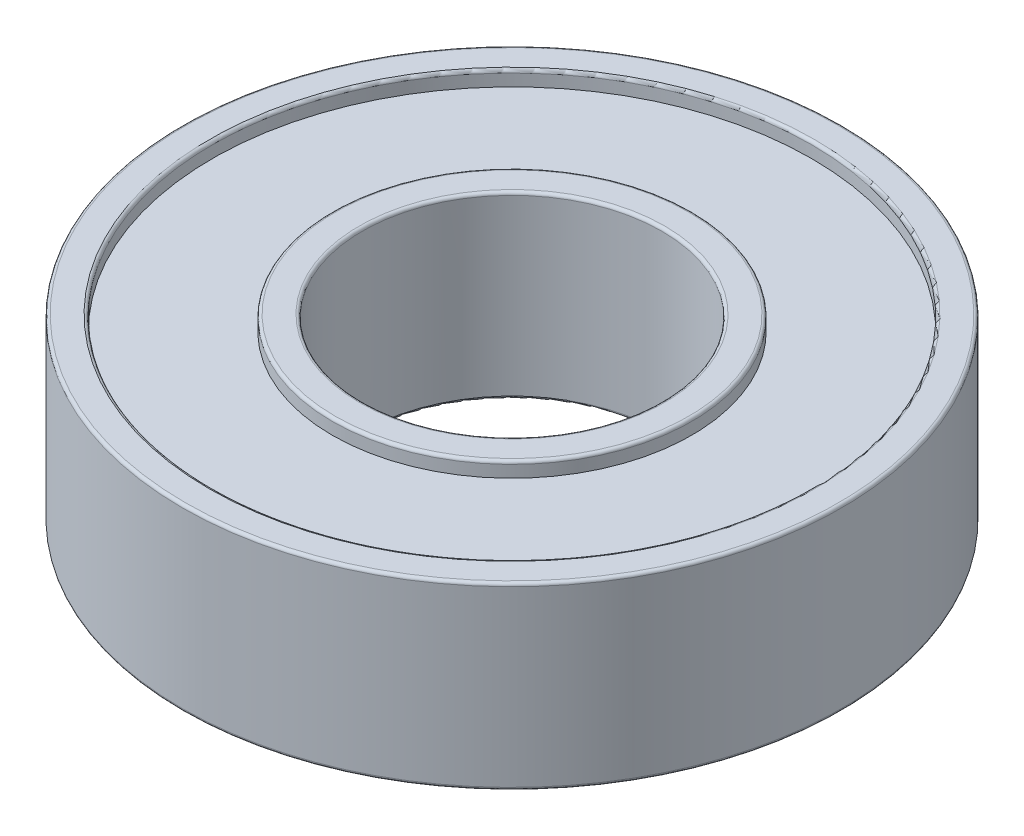
ISO-10303-21;
HEADER;
FILE_DESCRIPTION(('STEP AP214'),'2;1');
FILE_NAME('part.step','',(''),(''),'','','');
FILE_SCHEMA(('AUTOMOTIVE_DESIGN { 1 0 10303 214 1 1 1 1 }'));
ENDSEC;
DATA;
#1=APPLICATION_CONTEXT('core data for automotive mechanical design processes');
#2=APPLICATION_PROTOCOL_DEFINITION('international standard','automotive_design',2000,#1);
#3=PRODUCT_CONTEXT('',#1,'mechanical');
#4=PRODUCT('Part','Part','',(#3));
#5=PRODUCT_RELATED_PRODUCT_CATEGORY('part','',(#4));
#6=PRODUCT_DEFINITION_FORMATION('','',#4);
#7=PRODUCT_DEFINITION_CONTEXT('part definition',#1,'design');
#8=PRODUCT_DEFINITION('design','',#6,#7);
#9=PRODUCT_DEFINITION_SHAPE('','',#8);
#10=(LENGTH_UNIT() NAMED_UNIT(*) SI_UNIT(.MILLI.,.METRE.));
#11=(NAMED_UNIT(*) PLANE_ANGLE_UNIT() SI_UNIT($,.RADIAN.));
#12=(NAMED_UNIT(*) SI_UNIT($,.STERADIAN.) SOLID_ANGLE_UNIT());
#13=UNCERTAINTY_MEASURE_WITH_UNIT(LENGTH_MEASURE(1.E-05),#10,'distance_accuracy_value','');
#14=(GEOMETRIC_REPRESENTATION_CONTEXT(3) GLOBAL_UNCERTAINTY_ASSIGNED_CONTEXT((#13)) GLOBAL_UNIT_ASSIGNED_CONTEXT((#10,
#11,#12)) REPRESENTATION_CONTEXT('',''));
#15=CARTESIAN_POINT('',(0.,0.,0.));
#16=DIRECTION('',(0.,0.,1.));
#17=DIRECTION('',(1.,0.,0.));
#18=AXIS2_PLACEMENT_3D('',#15,#16,#17);
#19=CARTESIAN_POINT('',(0.,-2.5,-10.));
#20=DIRECTION('',(0.,-1.,0.));
#21=DIRECTION('',(0.,0.,-1.));
#22=AXIS2_PLACEMENT_3D('',#19,#20,#21);
#23=PLANE('',#22);
#24=CARTESIAN_POINT('',(0.,-2.5,0.));
#25=DIRECTION('',(0.,-1.,0.));
#26=DIRECTION('',(0.,0.,-1.));
#27=AXIS2_PLACEMENT_3D('',#24,#25,#26);
#28=CIRCLE('',#27,6.);
#29=CARTESIAN_POINT('',(0.,-2.5,-6.));
#30=VERTEX_POINT('',#29);
#31=EDGE_CURVE('E416',#30,#30,#28,.T.);
#32=ORIENTED_EDGE('',*,*,#31,.F.);
#33=EDGE_LOOP('',(#32));
#34=FACE_BOUND('',#33,.T.);
#35=CARTESIAN_POINT('',(0.,-2.5,0.));
#36=DIRECTION('',(0.,-1.,0.));
#37=DIRECTION('',(0.,0.,-1.));
#38=AXIS2_PLACEMENT_3D('',#35,#36,#37);
#39=CIRCLE('',#38,10.);
#40=CARTESIAN_POINT('',(0.,-2.5,-10.));
#41=VERTEX_POINT('',#40);
#42=EDGE_CURVE('E412',#41,#41,#39,.T.);
#43=ORIENTED_EDGE('',*,*,#42,.T.);
#44=EDGE_LOOP('',(#43));
#45=FACE_BOUND('',#44,.T.);
#46=ADVANCED_FACE('F16',(#34,#45),#23,.T.);
#47=CARTESIAN_POINT('',(0.,0.,0.));
#48=DIRECTION('',(0.,-1.,0.));
#49=DIRECTION('',(0.,0.,-1.));
#50=AXIS2_PLACEMENT_3D('',#47,#48,#49);
#51=CYLINDRICAL_SURFACE('',#50,6.);
#52=ORIENTED_EDGE('',*,*,#31,.T.);
#53=EDGE_LOOP('',(#52));
#54=FACE_BOUND('',#53,.T.);
#55=CARTESIAN_POINT('',(0.,-2.9,0.));
#56=DIRECTION('',(0.,-1.,0.));
#57=DIRECTION('',(0.,0.,-1.));
#58=AXIS2_PLACEMENT_3D('',#55,#56,#57);
#59=CIRCLE('',#58,6.);
#60=CARTESIAN_POINT('',(0.,-2.9,-6.));
#61=VERTEX_POINT('',#60);
#62=EDGE_CURVE('E415',#61,#61,#59,.T.);
#63=ORIENTED_EDGE('',*,*,#62,.F.);
#64=EDGE_LOOP('',(#63));
#65=FACE_BOUND('',#64,.T.);
#66=ADVANCED_FACE('F505',(#54,#65),#51,.T.);
#67=CARTESIAN_POINT('',(0.,0.,0.));
#68=DIRECTION('',(0.,-1.,0.));
#69=DIRECTION('',(0.,0.,-1.));
#70=AXIS2_PLACEMENT_3D('',#67,#68,#69);
#71=CYLINDRICAL_SURFACE('',#70,10.);
#72=ORIENTED_EDGE('',*,*,#42,.F.);
#73=EDGE_LOOP('',(#72));
#74=FACE_BOUND('',#73,.T.);
#75=CARTESIAN_POINT('',(0.,-2.9,0.));
#76=DIRECTION('',(0.,-1.,0.));
#77=DIRECTION('',(0.,0.,-1.));
#78=AXIS2_PLACEMENT_3D('',#75,#76,#77);
#79=CIRCLE('',#78,10.);
#80=CARTESIAN_POINT('',(0.,-2.9,-10.));
#81=VERTEX_POINT('',#80);
#82=EDGE_CURVE('E93',#81,#81,#79,.F.);
#83=ORIENTED_EDGE('',*,*,#82,.F.);
#84=EDGE_LOOP('',(#83));
#85=FACE_BOUND('',#84,.T.);
#86=ADVANCED_FACE('F490',(#74,#85),#71,.F.);
#87=CARTESIAN_POINT('',(0.,-2.9,0.));
#88=DIRECTION('',(0.,-1.,0.));
#89=DIRECTION('',(0.,0.,-1.));
#90=AXIS2_PLACEMENT_3D('',#87,#88,#89);
#91=TOROIDAL_SURFACE('',#90,5.9,0.1);
#92=ORIENTED_EDGE('',*,*,#62,.T.);
#93=EDGE_LOOP('',(#92));
#94=FACE_BOUND('',#93,.T.);
#95=CARTESIAN_POINT('',(0.,-3.,0.));
#96=DIRECTION('',(0.,1.,0.));
#97=DIRECTION('',(0.,0.,-1.));
#98=AXIS2_PLACEMENT_3D('',#95,#96,#97);
#99=CIRCLE('',#98,5.9);
#100=CARTESIAN_POINT('',(0.,-3.,5.9));
#101=VERTEX_POINT('',#100);
#102=CARTESIAN_POINT('',(0.,-3.,-5.9));
#103=VERTEX_POINT('',#102);
#104=EDGE_CURVE('E82',#101,#103,#99,.F.);
#105=ORIENTED_EDGE('',*,*,#104,.F.);
#106=CARTESIAN_POINT('',(0.,-3.,0.));
#107=DIRECTION('',(0.,1.,0.));
#108=DIRECTION('',(0.,0.,1.));
#109=AXIS2_PLACEMENT_3D('',#106,#107,#108);
#110=CIRCLE('',#109,5.9);
#111=EDGE_CURVE('E80',#103,#101,#110,.F.);
#112=ORIENTED_EDGE('',*,*,#111,.F.);
#113=EDGE_LOOP('',(#105,#112));
#114=FACE_BOUND('',#113,.T.);
#115=ADVANCED_FACE('F84',(#94,#114),#91,.T.);
#116=CARTESIAN_POINT('',(0.,-2.9,0.));
#117=DIRECTION('',(0.,-1.,0.));
#118=DIRECTION('',(0.,0.,-1.));
#119=AXIS2_PLACEMENT_3D('',#116,#117,#118);
#120=TOROIDAL_SURFACE('',#119,10.1,0.1);
#121=ORIENTED_EDGE('',*,*,#82,.T.);
#122=EDGE_LOOP('',(#121));
#123=FACE_BOUND('',#122,.T.);
#124=CARTESIAN_POINT('',(0.,-3.,0.));
#125=DIRECTION('',(0.,-1.,0.));
#126=DIRECTION('',(0.,0.,-1.));
#127=AXIS2_PLACEMENT_3D('',#124,#125,#126);
#128=CIRCLE('',#127,10.1);
#129=CARTESIAN_POINT('',(0.,-3.,10.1));
#130=VERTEX_POINT('',#129);
#131=CARTESIAN_POINT('',(0.,-3.,-10.1));
#132=VERTEX_POINT('',#131);
#133=EDGE_CURVE('E176',#130,#132,#128,.F.);
#134=ORIENTED_EDGE('',*,*,#133,.F.);
#135=CARTESIAN_POINT('',(0.,-3.,0.));
#136=DIRECTION('',(0.,-1.,0.));
#137=DIRECTION('',(0.,0.,1.));
#138=AXIS2_PLACEMENT_3D('',#135,#136,#137);
#139=CIRCLE('',#138,10.1);
#140=EDGE_CURVE('E87',#132,#130,#139,.F.);
#141=ORIENTED_EDGE('',*,*,#140,.F.);
#142=EDGE_LOOP('',(#134,#141));
#143=FACE_BOUND('',#142,.T.);
#144=ADVANCED_FACE('F113',(#123,#143),#120,.T.);
#145=CARTESIAN_POINT('',(0.,-3.,-5.));
#146=DIRECTION('',(0.,-1.,0.));
#147=DIRECTION('',(0.,0.,-1.));
#148=AXIS2_PLACEMENT_3D('',#145,#146,#147);
#149=PLANE('',#148);
#150=ORIENTED_EDGE('',*,*,#111,.T.);
#151=ORIENTED_EDGE('',*,*,#104,.T.);
#152=EDGE_LOOP('',(#150,#151));
#153=FACE_BOUND('',#152,.T.);
#154=CARTESIAN_POINT('',(0.,-3.,0.));
#155=DIRECTION('',(0.,-1.,0.));
#156=DIRECTION('',(0.,0.,1.));
#157=AXIS2_PLACEMENT_3D('',#154,#155,#156);
#158=CIRCLE('',#157,5.1);
#159=CARTESIAN_POINT('',(0.,-3.,5.1));
#160=VERTEX_POINT('',#159);
#161=CARTESIAN_POINT('',(0.,-3.,-5.1));
#162=VERTEX_POINT('',#161);
#163=EDGE_CURVE('E217',#160,#162,#158,.T.);
#164=ORIENTED_EDGE('',*,*,#163,.F.);
#165=CARTESIAN_POINT('',(0.,-3.,0.));
#166=DIRECTION('',(0.,-1.,0.));
#167=DIRECTION('',(0.,0.,-1.));
#168=AXIS2_PLACEMENT_3D('',#165,#166,#167);
#169=CIRCLE('',#168,5.1);
#170=EDGE_CURVE('E137',#162,#160,#169,.T.);
#171=ORIENTED_EDGE('',*,*,#170,.F.);
#172=EDGE_LOOP('',(#164,#171));
#173=FACE_BOUND('',#172,.T.);
#174=ADVANCED_FACE('F91',(#153,#173),#149,.T.);
#175=CARTESIAN_POINT('',(0.,-3.,-11.));
#176=DIRECTION('',(0.,-1.,0.));
#177=DIRECTION('',(0.,0.,-1.));
#178=AXIS2_PLACEMENT_3D('',#175,#176,#177);
#179=PLANE('',#178);
#180=CARTESIAN_POINT('',(0.,-3.,0.));
#181=DIRECTION('',(0.,1.,0.));
#182=DIRECTION('',(0.,0.,1.));
#183=AXIS2_PLACEMENT_3D('',#180,#181,#182);
#184=CIRCLE('',#183,10.9);
#185=CARTESIAN_POINT('',(0.,-3.,10.9));
#186=VERTEX_POINT('',#185);
#187=CARTESIAN_POINT('',(0.,-3.,-10.9));
#188=VERTEX_POINT('',#187);
#189=EDGE_CURVE('E188',#186,#188,#184,.T.);
#190=ORIENTED_EDGE('',*,*,#189,.F.);
#191=CARTESIAN_POINT('',(0.,-3.,0.));
#192=DIRECTION('',(0.,1.,0.));
#193=DIRECTION('',(0.,0.,-1.));
#194=AXIS2_PLACEMENT_3D('',#191,#192,#193);
#195=CIRCLE('',#194,10.9);
#196=EDGE_CURVE('E199',#188,#186,#195,.T.);
#197=ORIENTED_EDGE('',*,*,#196,.F.);
#198=EDGE_LOOP('',(#190,#197));
#199=FACE_BOUND('',#198,.T.);
#200=ORIENTED_EDGE('',*,*,#140,.T.);
#201=ORIENTED_EDGE('',*,*,#133,.T.);
#202=EDGE_LOOP('',(#200,#201));
#203=FACE_BOUND('',#202,.T.);
#204=ADVANCED_FACE('F112',(#199,#203),#179,.T.);
#205=CARTESIAN_POINT('',(0.,-2.9,0.));
#206=DIRECTION('',(0.,-1.,0.));
#207=DIRECTION('',(0.,0.,-1.));
#208=AXIS2_PLACEMENT_3D('',#205,#206,#207);
#209=TOROIDAL_SURFACE('',#208,5.1,0.1);
#210=CARTESIAN_POINT('',(0.,-2.9,0.));
#211=DIRECTION('',(0.,-1.,0.));
#212=DIRECTION('',(0.,0.,-1.));
#213=AXIS2_PLACEMENT_3D('',#210,#211,#212);
#214=CIRCLE('',#213,5.);
#215=CARTESIAN_POINT('',(0.,-2.9,-5.));
#216=VERTEX_POINT('',#215);
#217=EDGE_CURVE('E161',#216,#216,#214,.F.);
#218=ORIENTED_EDGE('',*,*,#217,.T.);
#219=EDGE_LOOP('',(#218));
#220=FACE_BOUND('',#219,.T.);
#221=ORIENTED_EDGE('',*,*,#170,.T.);
#222=ORIENTED_EDGE('',*,*,#163,.T.);
#223=EDGE_LOOP('',(#221,#222));
#224=FACE_BOUND('',#223,.T.);
#225=ADVANCED_FACE('F142',(#220,#224),#209,.T.);
#226=CARTESIAN_POINT('',(0.,-2.9,0.));
#227=DIRECTION('',(0.,-1.,0.));
#228=DIRECTION('',(0.,0.,-1.));
#229=AXIS2_PLACEMENT_3D('',#226,#227,#228);
#230=TOROIDAL_SURFACE('',#229,10.9,0.1);
#231=CARTESIAN_POINT('',(0.,-2.9,0.));
#232=DIRECTION('',(0.,-1.,0.));
#233=DIRECTION('',(0.,0.,-1.));
#234=AXIS2_PLACEMENT_3D('',#231,#232,#233);
#235=CIRCLE('',#234,11.);
#236=CARTESIAN_POINT('',(0.,-2.9,-11.));
#237=VERTEX_POINT('',#236);
#238=EDGE_CURVE('E221',#237,#237,#235,.F.);
#239=ORIENTED_EDGE('',*,*,#238,.F.);
#240=EDGE_LOOP('',(#239));
#241=FACE_BOUND('',#240,.T.);
#242=ORIENTED_EDGE('',*,*,#196,.T.);
#243=ORIENTED_EDGE('',*,*,#189,.T.);
#244=EDGE_LOOP('',(#242,#243));
#245=FACE_BOUND('',#244,.T.);
#246=ADVANCED_FACE('F152',(#241,#245),#230,.T.);
#247=CARTESIAN_POINT('',(0.,0.,0.));
#248=DIRECTION('',(0.,-1.,0.));
#249=DIRECTION('',(0.,0.,-1.));
#250=AXIS2_PLACEMENT_3D('',#247,#248,#249);
#251=CYLINDRICAL_SURFACE('',#250,5.);
#252=CARTESIAN_POINT('',(0.,2.9,0.));
#253=DIRECTION('',(0.,1.,0.));
#254=DIRECTION('',(0.,0.,1.));
#255=AXIS2_PLACEMENT_3D('',#252,#253,#254);
#256=CIRCLE('',#255,5.);
#257=CARTESIAN_POINT('',(0.,2.9,5.));
#258=VERTEX_POINT('',#257);
#259=EDGE_CURVE('E224',#258,#258,#256,.F.);
#260=ORIENTED_EDGE('',*,*,#259,.F.);
#261=EDGE_LOOP('',(#260));
#262=FACE_BOUND('',#261,.T.);
#263=ORIENTED_EDGE('',*,*,#217,.F.);
#264=EDGE_LOOP('',(#263));
#265=FACE_BOUND('',#264,.T.);
#266=ADVANCED_FACE('F565',(#262,#265),#251,.F.);
#267=CARTESIAN_POINT('',(0.,0.,0.));
#268=DIRECTION('',(0.,-1.,0.));
#269=DIRECTION('',(0.,0.,-1.));
#270=AXIS2_PLACEMENT_3D('',#267,#268,#269);
#271=CYLINDRICAL_SURFACE('',#270,11.);
#272=CARTESIAN_POINT('',(0.,2.9,0.));
#273=DIRECTION('',(0.,1.,0.));
#274=DIRECTION('',(0.,0.,1.));
#275=AXIS2_PLACEMENT_3D('',#272,#273,#274);
#276=CIRCLE('',#275,11.);
#277=CARTESIAN_POINT('',(0.,2.9,11.));
#278=VERTEX_POINT('',#277);
#279=EDGE_CURVE('E228',#278,#278,#276,.T.);
#280=ORIENTED_EDGE('',*,*,#279,.F.);
#281=EDGE_LOOP('',(#280));
#282=FACE_BOUND('',#281,.T.);
#283=ORIENTED_EDGE('',*,*,#238,.T.);
#284=EDGE_LOOP('',(#283));
#285=FACE_BOUND('',#284,.T.);
#286=ADVANCED_FACE('F251',(#282,#285),#271,.T.);
#287=CARTESIAN_POINT('',(0.,2.9,0.));
#288=DIRECTION('',(0.,1.,0.));
#289=DIRECTION('',(0.,0.,1.));
#290=AXIS2_PLACEMENT_3D('',#287,#288,#289);
#291=TOROIDAL_SURFACE('',#290,5.1,0.1);
#292=ORIENTED_EDGE('',*,*,#259,.T.);
#293=EDGE_LOOP('',(#292));
#294=FACE_BOUND('',#293,.T.);
#295=CARTESIAN_POINT('',(0.,3.,0.));
#296=DIRECTION('',(0.,1.,0.));
#297=DIRECTION('',(0.,0.,1.));
#298=AXIS2_PLACEMENT_3D('',#295,#296,#297);
#299=CIRCLE('',#298,5.1);
#300=CARTESIAN_POINT('',(0.,3.,-5.1));
#301=VERTEX_POINT('',#300);
#302=CARTESIAN_POINT('',(0.,3.,5.1));
#303=VERTEX_POINT('',#302);
#304=EDGE_CURVE('E385',#301,#303,#299,.F.);
#305=ORIENTED_EDGE('',*,*,#304,.F.);
#306=CARTESIAN_POINT('',(0.,3.,0.));
#307=DIRECTION('',(0.,1.,0.));
#308=DIRECTION('',(0.,0.,-1.));
#309=AXIS2_PLACEMENT_3D('',#306,#307,#308);
#310=CIRCLE('',#309,5.1);
#311=EDGE_CURVE('E234',#303,#301,#310,.F.);
#312=ORIENTED_EDGE('',*,*,#311,.F.);
#313=EDGE_LOOP('',(#305,#312));
#314=FACE_BOUND('',#313,.T.);
#315=ADVANCED_FACE('F240',(#294,#314),#291,.T.);
#316=CARTESIAN_POINT('',(0.,2.9,0.));
#317=DIRECTION('',(0.,1.,0.));
#318=DIRECTION('',(0.,0.,1.));
#319=AXIS2_PLACEMENT_3D('',#316,#317,#318);
#320=TOROIDAL_SURFACE('',#319,10.9,0.1);
#321=ORIENTED_EDGE('',*,*,#279,.T.);
#322=EDGE_LOOP('',(#321));
#323=FACE_BOUND('',#322,.T.);
#324=CARTESIAN_POINT('',(0.,3.,0.));
#325=DIRECTION('',(0.,-1.,0.));
#326=DIRECTION('',(0.,0.,1.));
#327=AXIS2_PLACEMENT_3D('',#324,#325,#326);
#328=CIRCLE('',#327,10.9);
#329=CARTESIAN_POINT('',(0.,3.,-10.9));
#330=VERTEX_POINT('',#329);
#331=CARTESIAN_POINT('',(0.,3.,10.9));
#332=VERTEX_POINT('',#331);
#333=EDGE_CURVE('E269',#330,#332,#328,.F.);
#334=ORIENTED_EDGE('',*,*,#333,.F.);
#335=CARTESIAN_POINT('',(0.,3.,0.));
#336=DIRECTION('',(0.,-1.,0.));
#337=DIRECTION('',(0.,0.,-1.));
#338=AXIS2_PLACEMENT_3D('',#335,#336,#337);
#339=CIRCLE('',#338,10.9);
#340=EDGE_CURVE('E305',#332,#330,#339,.F.);
#341=ORIENTED_EDGE('',*,*,#340,.F.);
#342=EDGE_LOOP('',(#334,#341));
#343=FACE_BOUND('',#342,.T.);
#344=ADVANCED_FACE('F250',(#323,#343),#320,.T.);
#345=CARTESIAN_POINT('',(0.,3.,-5.));
#346=DIRECTION('',(0.,1.,0.));
#347=DIRECTION('',(0.,0.,1.));
#348=AXIS2_PLACEMENT_3D('',#345,#346,#347);
#349=PLANE('',#348);
#350=ORIENTED_EDGE('',*,*,#311,.T.);
#351=ORIENTED_EDGE('',*,*,#304,.T.);
#352=EDGE_LOOP('',(#350,#351));
#353=FACE_BOUND('',#352,.T.);
#354=CARTESIAN_POINT('',(0.,3.,0.));
#355=DIRECTION('',(0.,-1.,0.));
#356=DIRECTION('',(0.,0.,-1.));
#357=AXIS2_PLACEMENT_3D('',#354,#355,#356);
#358=CIRCLE('',#357,5.9);
#359=CARTESIAN_POINT('',(0.,3.,-5.9));
#360=VERTEX_POINT('',#359);
#361=CARTESIAN_POINT('',(0.,3.,5.9));
#362=VERTEX_POINT('',#361);
#363=EDGE_CURVE('E354',#360,#362,#358,.T.);
#364=ORIENTED_EDGE('',*,*,#363,.F.);
#365=CARTESIAN_POINT('',(0.,3.,0.));
#366=DIRECTION('',(0.,-1.,0.));
#367=DIRECTION('',(0.,0.,1.));
#368=AXIS2_PLACEMENT_3D('',#365,#366,#367);
#369=CIRCLE('',#368,5.9);
#370=EDGE_CURVE('E394',#362,#360,#369,.T.);
#371=ORIENTED_EDGE('',*,*,#370,.F.);
#372=EDGE_LOOP('',(#364,#371));
#373=FACE_BOUND('',#372,.T.);
#374=ADVANCED_FACE('F359',(#353,#373),#349,.T.);
#375=CARTESIAN_POINT('',(0.,3.,-11.));
#376=DIRECTION('',(0.,1.,0.));
#377=DIRECTION('',(0.,0.,1.));
#378=AXIS2_PLACEMENT_3D('',#375,#376,#377);
#379=PLANE('',#378);
#380=CARTESIAN_POINT('',(0.,3.,0.));
#381=DIRECTION('',(0.,1.,0.));
#382=DIRECTION('',(0.,0.,-1.));
#383=AXIS2_PLACEMENT_3D('',#380,#381,#382);
#384=CIRCLE('',#383,10.1);
#385=CARTESIAN_POINT('',(0.,3.,-10.1));
#386=VERTEX_POINT('',#385);
#387=CARTESIAN_POINT('',(0.,3.,10.1));
#388=VERTEX_POINT('',#387);
#389=EDGE_CURVE('E324',#386,#388,#384,.T.);
#390=ORIENTED_EDGE('',*,*,#389,.F.);
#391=CARTESIAN_POINT('',(0.,3.,0.));
#392=DIRECTION('',(0.,1.,0.));
#393=DIRECTION('',(0.,0.,1.));
#394=AXIS2_PLACEMENT_3D('',#391,#392,#393);
#395=CIRCLE('',#394,10.1);
#396=EDGE_CURVE('E35',#388,#386,#395,.T.);
#397=ORIENTED_EDGE('',*,*,#396,.F.);
#398=EDGE_LOOP('',(#390,#397));
#399=FACE_BOUND('',#398,.T.);
#400=ORIENTED_EDGE('',*,*,#340,.T.);
#401=ORIENTED_EDGE('',*,*,#333,.T.);
#402=EDGE_LOOP('',(#400,#401));
#403=FACE_BOUND('',#402,.T.);
#404=ADVANCED_FACE('F291',(#399,#403),#379,.T.);
#405=CARTESIAN_POINT('',(0.,2.9,0.));
#406=DIRECTION('',(0.,1.,0.));
#407=DIRECTION('',(0.,0.,1.));
#408=AXIS2_PLACEMENT_3D('',#405,#406,#407);
#409=TOROIDAL_SURFACE('',#408,5.9,0.1);
#410=CARTESIAN_POINT('',(0.,2.9,0.));
#411=DIRECTION('',(0.,-1.,0.));
#412=DIRECTION('',(0.,0.,-1.));
#413=AXIS2_PLACEMENT_3D('',#410,#411,#412);
#414=CIRCLE('',#413,6.);
#415=CARTESIAN_POINT('',(0.,2.9,-6.));
#416=VERTEX_POINT('',#415);
#417=EDGE_CURVE('E301',#416,#416,#414,.T.);
#418=ORIENTED_EDGE('',*,*,#417,.F.);
#419=EDGE_LOOP('',(#418));
#420=FACE_BOUND('',#419,.T.);
#421=ORIENTED_EDGE('',*,*,#370,.T.);
#422=ORIENTED_EDGE('',*,*,#363,.T.);
#423=EDGE_LOOP('',(#421,#422));
#424=FACE_BOUND('',#423,.T.);
#425=ADVANCED_FACE('F279',(#420,#424),#409,.T.);
#426=CARTESIAN_POINT('',(0.,2.9,0.));
#427=DIRECTION('',(0.,1.,0.));
#428=DIRECTION('',(0.,0.,1.));
#429=AXIS2_PLACEMENT_3D('',#426,#427,#428);
#430=TOROIDAL_SURFACE('',#429,10.1,0.1);
#431=ORIENTED_EDGE('',*,*,#396,.T.);
#432=ORIENTED_EDGE('',*,*,#389,.T.);
#433=EDGE_LOOP('',(#431,#432));
#434=FACE_BOUND('',#433,.T.);
#435=CARTESIAN_POINT('',(0.,2.9,0.));
#436=DIRECTION('',(0.,-1.,0.));
#437=DIRECTION('',(0.,0.,-1.));
#438=AXIS2_PLACEMENT_3D('',#435,#436,#437);
#439=CIRCLE('',#438,10.);
#440=CARTESIAN_POINT('',(0.,2.9,-10.));
#441=VERTEX_POINT('',#440);
#442=EDGE_CURVE('E399',#441,#441,#439,.T.);
#443=ORIENTED_EDGE('',*,*,#442,.T.);
#444=EDGE_LOOP('',(#443));
#445=FACE_BOUND('',#444,.T.);
#446=ADVANCED_FACE('F290',(#434,#445),#430,.T.);
#447=CARTESIAN_POINT('',(0.,0.,0.));
#448=DIRECTION('',(0.,-1.,0.));
#449=DIRECTION('',(0.,0.,-1.));
#450=AXIS2_PLACEMENT_3D('',#447,#448,#449);
#451=CYLINDRICAL_SURFACE('',#450,6.);
#452=ORIENTED_EDGE('',*,*,#417,.T.);
#453=EDGE_LOOP('',(#452));
#454=FACE_BOUND('',#453,.T.);
#455=CARTESIAN_POINT('',(0.,2.5,0.));
#456=DIRECTION('',(0.,-1.,0.));
#457=DIRECTION('',(0.,0.,-1.));
#458=AXIS2_PLACEMENT_3D('',#455,#456,#457);
#459=CIRCLE('',#458,6.);
#460=CARTESIAN_POINT('',(0.,2.5,-6.));
#461=VERTEX_POINT('',#460);
#462=EDGE_CURVE('E27',#461,#461,#459,.T.);
#463=ORIENTED_EDGE('',*,*,#462,.F.);
#464=EDGE_LOOP('',(#463));
#465=FACE_BOUND('',#464,.T.);
#466=ADVANCED_FACE('F524',(#454,#465),#451,.T.);
#467=CARTESIAN_POINT('',(0.,0.,0.));
#468=DIRECTION('',(0.,-1.,0.));
#469=DIRECTION('',(0.,0.,-1.));
#470=AXIS2_PLACEMENT_3D('',#467,#468,#469);
#471=CYLINDRICAL_SURFACE('',#470,10.);
#472=CARTESIAN_POINT('',(0.,2.5,0.));
#473=DIRECTION('',(0.,-1.,0.));
#474=DIRECTION('',(0.,0.,-1.));
#475=AXIS2_PLACEMENT_3D('',#472,#473,#474);
#476=CIRCLE('',#475,10.);
#477=CARTESIAN_POINT('',(0.,2.5,-10.));
#478=VERTEX_POINT('',#477);
#479=EDGE_CURVE('E11',#478,#478,#476,.F.);
#480=ORIENTED_EDGE('',*,*,#479,.F.);
#481=EDGE_LOOP('',(#480));
#482=FACE_BOUND('',#481,.T.);
#483=ORIENTED_EDGE('',*,*,#442,.F.);
#484=EDGE_LOOP('',(#483));
#485=FACE_BOUND('',#484,.T.);
#486=ADVANCED_FACE('F518',(#482,#485),#471,.F.);
#487=CARTESIAN_POINT('',(0.,2.5,-10.));
#488=DIRECTION('',(0.,1.,0.));
#489=DIRECTION('',(0.,0.,1.));
#490=AXIS2_PLACEMENT_3D('',#487,#488,#489);
#491=PLANE('',#490);
#492=ORIENTED_EDGE('',*,*,#479,.T.);
#493=EDGE_LOOP('',(#492));
#494=FACE_BOUND('',#493,.T.);
#495=ORIENTED_EDGE('',*,*,#462,.T.);
#496=EDGE_LOOP('',(#495));
#497=FACE_BOUND('',#496,.T.);
#498=ADVANCED_FACE('F516',(#494,#497),#491,.T.);
#499=CLOSED_SHELL('',(#46,#66,#86,#115,#144,#174,#204,#225,#246,#266,#286,#315,#344,#374,#404,
#425,#446,#466,#486,#498));
#500=MANIFOLD_SOLID_BREP('B1',#499);
#501=ADVANCED_BREP_SHAPE_REPRESENTATION('',(#18,#500),#14);
#502=SHAPE_DEFINITION_REPRESENTATION(#9,#501);
ENDSEC;
END-ISO-10303-21;
